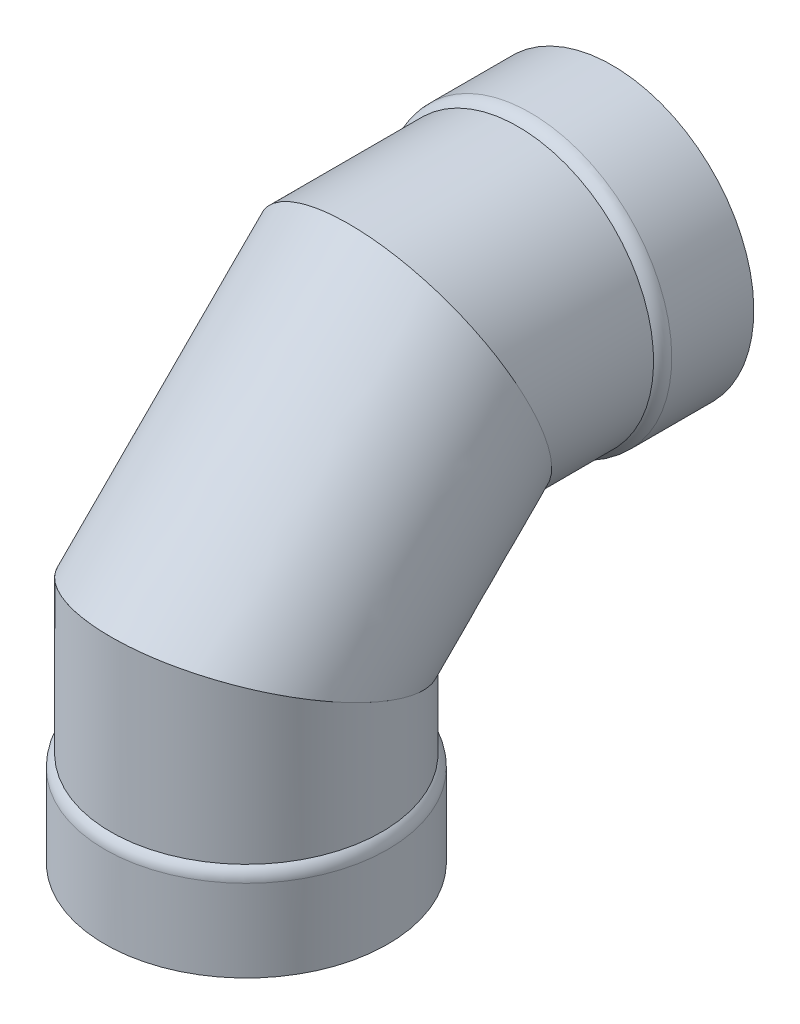
ISO-10303-21;
HEADER;
FILE_DESCRIPTION(('STEP AP214'),'2;1');
FILE_NAME('part.step','',(''),(''),'','','');
FILE_SCHEMA(('AUTOMOTIVE_DESIGN { 1 0 10303 214 1 1 1 1 }'));
ENDSEC;
DATA;
#1=APPLICATION_CONTEXT('core data for automotive mechanical design processes');
#2=APPLICATION_PROTOCOL_DEFINITION('international standard','automotive_design',2000,#1);
#3=PRODUCT_CONTEXT('',#1,'mechanical');
#4=PRODUCT('Part','Part','',(#3));
#5=PRODUCT_RELATED_PRODUCT_CATEGORY('part','',(#4));
#6=PRODUCT_DEFINITION_FORMATION('','',#4);
#7=PRODUCT_DEFINITION_CONTEXT('part definition',#1,'design');
#8=PRODUCT_DEFINITION('design','',#6,#7);
#9=PRODUCT_DEFINITION_SHAPE('','',#8);
#10=(LENGTH_UNIT() NAMED_UNIT(*) SI_UNIT(.MILLI.,.METRE.));
#11=(NAMED_UNIT(*) PLANE_ANGLE_UNIT() SI_UNIT($,.RADIAN.));
#12=(NAMED_UNIT(*) SI_UNIT($,.STERADIAN.) SOLID_ANGLE_UNIT());
#13=UNCERTAINTY_MEASURE_WITH_UNIT(LENGTH_MEASURE(1.E-05),#10,'distance_accuracy_value','');
#14=(GEOMETRIC_REPRESENTATION_CONTEXT(3) GLOBAL_UNCERTAINTY_ASSIGNED_CONTEXT((#13)) GLOBAL_UNIT_ASSIGNED_CONTEXT((#10,
#11,#12)) REPRESENTATION_CONTEXT('',''));
#15=CARTESIAN_POINT('',(0.,0.,0.));
#16=DIRECTION('',(0.,0.,1.));
#17=DIRECTION('',(1.,0.,0.));
#18=AXIS2_PLACEMENT_3D('',#15,#16,#17);
#19=CARTESIAN_POINT('',(0.,295.759197113444,-128.277947113444));
#20=DIRECTION('',(0.,-0.381760154419797,0.924261426490024));
#21=DIRECTION('',(0.,-0.924261426490024,-0.381760154419797));
#22=AXIS2_PLACEMENT_3D('',#19,#20,#21);
#23=PLANE('',#22);
#24=CARTESIAN_POINT('',(0.,295.759197113444,-128.277947113444));
#25=DIRECTION('',(0.,-0.381760154419797,0.924261426490024));
#26=DIRECTION('',(0.,-0.924261426490024,-0.381760154419797));
#27=AXIS2_PLACEMENT_3D('',#24,#25,#26);
#28=ELLIPSE('',#27,113.360784078043,104.775);
#29=CARTESIAN_POINT('',(0.,190.984197113444,-171.554577548227));
#30=VERTEX_POINT('',#29);
#31=EDGE_CURVE('E105',#30,#30,#28,.T.);
#32=ORIENTED_EDGE('',*,*,#31,.T.);
#33=EDGE_LOOP('',(#32));
#34=FACE_BOUND('',#33,.T.);
#35=CARTESIAN_POINT('',(0.,295.759197113444,-128.277947113444));
#36=DIRECTION('',(0.,-0.381760154419797,0.924261426490024));
#37=DIRECTION('',(0.,-0.924261426490024,-0.381760154419797));
#38=AXIS2_PLACEMENT_3D('',#35,#36,#37);
#39=ELLIPSE('',#38,118.513546990682,109.5375);
#40=CARTESIAN_POINT('',(0.,186.221697113444,-173.521697113444));
#41=VERTEX_POINT('',#40);
#42=EDGE_CURVE('E14',#41,#41,#39,.T.);
#43=ORIENTED_EDGE('',*,*,#42,.F.);
#44=EDGE_LOOP('',(#43));
#45=FACE_BOUND('',#44,.T.);
#46=ADVANCED_FACE('F88',(#34,#45),#23,.F.);
#47=CARTESIAN_POINT('',(0.,167.48125,0.));
#48=DIRECTION('',(0.,0.924261426490025,-0.381760154419793));
#49=DIRECTION('',(0.,0.381760154419793,0.924261426490025));
#50=AXIS2_PLACEMENT_3D('',#47,#48,#49);
#51=PLANE('',#50);
#52=CARTESIAN_POINT('',(0.,167.48125,0.));
#53=DIRECTION('',(0.,0.924261426490025,-0.381760154419793));
#54=DIRECTION('',(0.,-0.381760154419793,-0.924261426490025));
#55=AXIS2_PLACEMENT_3D('',#52,#53,#54);
#56=ELLIPSE('',#55,113.360784078043,104.775);
#57=CARTESIAN_POINT('',(0.,124.204619565217,-104.775));
#58=VERTEX_POINT('',#57);
#59=EDGE_CURVE('E119',#58,#58,#56,.T.);
#60=ORIENTED_EDGE('',*,*,#59,.T.);
#61=EDGE_LOOP('',(#60));
#62=FACE_BOUND('',#61,.T.);
#63=CARTESIAN_POINT('',(0.,167.48125,0.));
#64=DIRECTION('',(0.,0.924261426490025,-0.381760154419793));
#65=DIRECTION('',(0.,-0.381760154419793,-0.924261426490025));
#66=AXIS2_PLACEMENT_3D('',#63,#64,#65);
#67=ELLIPSE('',#66,118.513546990682,109.5375);
#68=CARTESIAN_POINT('',(0.,122.2375,-109.5375));
#69=VERTEX_POINT('',#68);
#70=EDGE_CURVE('E97',#69,#69,#67,.T.);
#71=ORIENTED_EDGE('',*,*,#70,.F.);
#72=EDGE_LOOP('',(#71));
#73=FACE_BOUND('',#72,.T.);
#74=ADVANCED_FACE('F127',(#62,#73),#51,.F.);
#75=CARTESIAN_POINT('',(0.0137264705965548,212.724999644761,109.537499139948));
#76=CARTESIAN_POINT('',(0.0441151894151282,405.296688229956,-83.0342007827096));
#77=CARTESIAN_POINT('',(219.088724750492,212.713660386442,109.510046198754));
#78=CARTESIAN_POINT('',(219.11909742244,405.208457851126,-83.07064376527));
#79=CARTESIAN_POINT('',(219.061271809299,122.22616109692,-109.564952081141));
#80=CARTESIAN_POINT('',(219.03086704361,186.133475618101,-173.558136426738));
#81=CARTESIAN_POINT('',(-0.0137264705966168,122.237500355239,-109.537499139948));
#82=CARTESIAN_POINT('',(-0.0441151894151416,186.221705996932,-173.521693444177));
#83=CARTESIAN_POINT('',(-219.088724750492,122.248839613558,-109.510046198754));
#84=CARTESIAN_POINT('',(-219.11909742244,186.309936375762,-173.485250461617));
#85=CARTESIAN_POINT('',(-219.061271809298,212.73633890308,109.564952081141));
#86=CARTESIAN_POINT('',(-219.03086704361,405.384918608787,-82.9977578001493));
#87=CARTESIAN_POINT('',(0.0137264705965548,212.724999644761,109.537499139948));
#88=CARTESIAN_POINT('',(0.0441151894151282,405.296688229956,-83.0342007827096));
#89=(BOUNDED_SURFACE() B_SPLINE_SURFACE(3,1,((#75,#76),(#77,#78),(#79,#80),(#81,#82),(#83,#84),
(#85,#86),(#87,#88)),.UNSPECIFIED.,.T.,.F.,.F.) B_SPLINE_SURFACE_WITH_KNOTS((4,3,4),(2,2),(0.,
0.5,1.),(0.,1.),.UNSPECIFIED.) GEOMETRIC_REPRESENTATION_ITEM() RATIONAL_B_SPLINE_SURFACE(((1.,
1.),(0.333333333333333,0.333333333333333),(0.333333333333333,0.333333333333333),(1.,1.),
(0.333333333333333,0.333333333333333),(0.333333333333333,0.333333333333333),(1.,1.))) REPRESENTATION_ITEM('') SURFACE());
#90=ORIENTED_EDGE('',*,*,#70,.T.);
#91=EDGE_LOOP('',(#90));
#92=FACE_BOUND('',#91,.T.);
#93=ORIENTED_EDGE('',*,*,#42,.T.);
#94=EDGE_LOOP('',(#93));
#95=FACE_BOUND('',#94,.T.);
#96=ADVANCED_FACE('F147',(#92,#95),#89,.T.);
#97=CARTESIAN_POINT('',(0.,124.204619565217,-104.775));
#98=CARTESIAN_POINT('',(0.,190.984197113444,-171.554577548227));
#99=CARTESIAN_POINT('',(-209.55,124.204619565217,-104.775));
#100=CARTESIAN_POINT('',(-209.55,190.984197113444,-171.554577548227));
#101=CARTESIAN_POINT('',(-209.55,210.757880434783,104.775));
#102=CARTESIAN_POINT('',(-209.55,400.534197113444,-85.0013166786605));
#103=CARTESIAN_POINT('',(0.,210.757880434783,104.775));
#104=CARTESIAN_POINT('',(0.,400.534197113444,-85.0013166786605));
#105=CARTESIAN_POINT('',(209.55,210.757880434783,104.775));
#106=CARTESIAN_POINT('',(209.55,400.534197113444,-85.0013166786605));
#107=CARTESIAN_POINT('',(209.55,124.204619565217,-104.775));
#108=CARTESIAN_POINT('',(209.55,190.984197113444,-171.554577548227));
#109=CARTESIAN_POINT('',(0.,124.204619565217,-104.775));
#110=CARTESIAN_POINT('',(0.,190.984197113444,-171.554577548227));
#111=(BOUNDED_SURFACE() B_SPLINE_SURFACE(3,1,((#97,#98),(#99,#100),(#101,#102),(#103,#104),
(#105,#106),(#107,#108),(#109,#110)),.UNSPECIFIED.,.T.,.F.,.F.) B_SPLINE_SURFACE_WITH_KNOTS((4,
3,4),(2,2),(0.,0.5,1.),(0.,1.),
.UNSPECIFIED.) GEOMETRIC_REPRESENTATION_ITEM() RATIONAL_B_SPLINE_SURFACE(((1.,1.),
(0.333333333333333,0.333333333333333),(0.333333333333333,0.333333333333333),(1.,1.),
(0.333333333333333,0.333333333333333),(0.333333333333333,0.333333333333333),(1.,1.))) REPRESENTATION_ITEM('') SURFACE());
#112=ORIENTED_EDGE('',*,*,#59,.F.);
#113=EDGE_LOOP('',(#112));
#114=FACE_BOUND('',#113,.T.);
#115=ORIENTED_EDGE('',*,*,#31,.F.);
#116=EDGE_LOOP('',(#115));
#117=FACE_BOUND('',#116,.T.);
#118=ADVANCED_FACE('F148',(#114,#117),#111,.F.);
#119=CLOSED_SHELL('',(#46,#74,#96,#118));
#120=MANIFOLD_SOLID_BREP('B2',#119);
#121=CARTESIAN_POINT('',(0.,295.759197113445,-347.872990216892));
#122=DIRECTION('',(0.,0.,-1.));
#123=DIRECTION('',(0.,-1.,0.));
#124=AXIS2_PLACEMENT_3D('',#121,#122,#123);
#125=CYLINDRICAL_SURFACE('',#124,109.5375);
#126=CARTESIAN_POINT('',(0.,295.759197113444,-219.559197113443));
#127=DIRECTION('',(0.,0.,1.));
#128=DIRECTION('',(0.,-1.,0.));
#129=AXIS2_PLACEMENT_3D('',#126,#127,#128);
#130=CIRCLE('',#129,109.5375);
#131=CARTESIAN_POINT('',(0.,186.221697113444,-219.559197113444));
#132=VERTEX_POINT('',#131);
#133=EDGE_CURVE('E297',#132,#132,#130,.T.);
#134=ORIENTED_EDGE('',*,*,#133,.T.);
#135=EDGE_LOOP('',(#134));
#136=FACE_BOUND('',#135,.T.);
#137=CARTESIAN_POINT('',(0.,295.759197113444,-128.277947113443));
#138=DIRECTION('',(0.,-0.381760154419797,0.924261426490024));
#139=DIRECTION('',(0.,-0.924261426490024,-0.381760154419796));
#140=AXIS2_PLACEMENT_3D('',#137,#138,#139);
#141=ELLIPSE('',#140,118.513546990682,109.5375);
#142=CARTESIAN_POINT('',(0.,186.221697113444,-173.521697113444));
#143=VERTEX_POINT('',#142);
#144=EDGE_CURVE('E309',#143,#143,#141,.T.);
#145=ORIENTED_EDGE('',*,*,#144,.F.);
#146=EDGE_LOOP('',(#145));
#147=FACE_BOUND('',#146,.T.);
#148=ADVANCED_FACE('F283',(#136,#147),#125,.T.);
#149=CARTESIAN_POINT('',(0.,295.759197113445,-347.872990216892));
#150=DIRECTION('',(0.,0.,-1.));
#151=DIRECTION('',(0.,-1.,0.));
#152=AXIS2_PLACEMENT_3D('',#149,#150,#151);
#153=CYLINDRICAL_SURFACE('',#152,114.3);
#154=CARTESIAN_POINT('',(0.,295.759197113444,-229.473131435901));
#155=DIRECTION('',(0.,0.,1.));
#156=DIRECTION('',(0.,-1.,0.));
#157=AXIS2_PLACEMENT_3D('',#154,#155,#156);
#158=CIRCLE('',#157,114.3);
#159=CARTESIAN_POINT('',(0.,181.459197113444,-229.473131435901));
#160=VERTEX_POINT('',#159);
#161=EDGE_CURVE('E291',#160,#160,#158,.F.);
#162=ORIENTED_EDGE('',*,*,#161,.T.);
#163=EDGE_LOOP('',(#162));
#164=FACE_BOUND('',#163,.T.);
#165=CARTESIAN_POINT('',(0.,295.759197113445,-295.759197113443));
#166=DIRECTION('',(0.,0.,1.));
#167=DIRECTION('',(0.,-1.,0.));
#168=AXIS2_PLACEMENT_3D('',#165,#166,#167);
#169=CIRCLE('',#168,114.3);
#170=CARTESIAN_POINT('',(0.,181.459197113445,-295.759197113444));
#171=VERTEX_POINT('',#170);
#172=EDGE_CURVE('E303',#171,#171,#169,.T.);
#173=ORIENTED_EDGE('',*,*,#172,.T.);
#174=EDGE_LOOP('',(#173));
#175=FACE_BOUND('',#174,.T.);
#176=ADVANCED_FACE('F330',(#164,#175),#153,.T.);
#177=CARTESIAN_POINT('',(0.,410.059197113445,-295.759197113443));
#178=DIRECTION('',(0.,0.,1.));
#179=DIRECTION('',(0.,1.,0.));
#180=AXIS2_PLACEMENT_3D('',#177,#178,#179);
#181=PLANE('',#180);
#182=CARTESIAN_POINT('',(0.,295.759197113445,-295.759197113443));
#183=DIRECTION('',(0.,0.,1.));
#184=DIRECTION('',(0.,-1.,0.));
#185=AXIS2_PLACEMENT_3D('',#182,#183,#184);
#186=CIRCLE('',#185,109.5375);
#187=CARTESIAN_POINT('',(0.,186.221697113445,-295.759197113444));
#188=VERTEX_POINT('',#187);
#189=EDGE_CURVE('E314',#188,#188,#186,.T.);
#190=ORIENTED_EDGE('',*,*,#189,.T.);
#191=EDGE_LOOP('',(#190));
#192=FACE_BOUND('',#191,.T.);
#193=ORIENTED_EDGE('',*,*,#172,.F.);
#194=EDGE_LOOP('',(#193));
#195=FACE_BOUND('',#194,.T.);
#196=ADVANCED_FACE('F336',(#192,#195),#181,.F.);
#197=CARTESIAN_POINT('',(0.,295.759197113445,-347.872990216892));
#198=DIRECTION('',(0.,0.,-1.));
#199=DIRECTION('',(0.,-1.,0.));
#200=AXIS2_PLACEMENT_3D('',#197,#198,#199);
#201=CYLINDRICAL_SURFACE('',#200,109.5375);
#202=CARTESIAN_POINT('',(0.,295.759197113444,-234.235631435901));
#203=DIRECTION('',(0.,0.,1.));
#204=DIRECTION('',(0.,-1.,0.));
#205=AXIS2_PLACEMENT_3D('',#202,#203,#204);
#206=CIRCLE('',#205,109.5375);
#207=CARTESIAN_POINT('',(0.,186.221697113444,-234.235631435901));
#208=VERTEX_POINT('',#207);
#209=EDGE_CURVE('E87',#208,#208,#206,.T.);
#210=ORIENTED_EDGE('',*,*,#209,.T.);
#211=EDGE_LOOP('',(#210));
#212=FACE_BOUND('',#211,.T.);
#213=ORIENTED_EDGE('',*,*,#189,.F.);
#214=EDGE_LOOP('',(#213));
#215=FACE_BOUND('',#214,.T.);
#216=ADVANCED_FACE('F355',(#212,#215),#201,.F.);
#217=CARTESIAN_POINT('',(0.,295.759197113445,-347.872990216892));
#218=DIRECTION('',(0.,0.,-1.));
#219=DIRECTION('',(0.,-1.,0.));
#220=AXIS2_PLACEMENT_3D('',#217,#218,#219);
#221=CYLINDRICAL_SURFACE('',#220,104.775);
#222=CARTESIAN_POINT('',(0.,295.759197113444,-128.277947113443));
#223=DIRECTION('',(0.,-0.381760154419797,0.924261426490024));
#224=DIRECTION('',(0.,-0.924261426490024,-0.381760154419796));
#225=AXIS2_PLACEMENT_3D('',#222,#223,#224);
#226=ELLIPSE('',#225,113.360784078043,104.775);
#227=CARTESIAN_POINT('',(0.,190.984197113444,-171.554577548226));
#228=VERTEX_POINT('',#227);
#229=EDGE_CURVE('E306',#228,#228,#226,.F.);
#230=ORIENTED_EDGE('',*,*,#229,.F.);
#231=EDGE_LOOP('',(#230));
#232=FACE_BOUND('',#231,.T.);
#233=CARTESIAN_POINT('',(0.,295.759197113444,-224.321697113443));
#234=DIRECTION('',(0.,0.,1.));
#235=DIRECTION('',(0.,-1.,0.));
#236=AXIS2_PLACEMENT_3D('',#233,#234,#235);
#237=CIRCLE('',#236,104.775);
#238=CARTESIAN_POINT('',(0.,190.984197113444,-224.321697113444));
#239=VERTEX_POINT('',#238);
#240=EDGE_CURVE('E318',#239,#239,#237,.T.);
#241=ORIENTED_EDGE('',*,*,#240,.F.);
#242=EDGE_LOOP('',(#241));
#243=FACE_BOUND('',#242,.T.);
#244=ADVANCED_FACE('F347',(#232,#243),#221,.F.);
#245=CARTESIAN_POINT('',(-114.3,405.296697113444,-83.0341971134431));
#246=DIRECTION('',(0.,0.381760154419797,-0.924261426490024));
#247=DIRECTION('',(0.,-0.924261426490024,-0.381760154419796));
#248=AXIS2_PLACEMENT_3D('',#245,#246,#247);
#249=PLANE('',#248);
#250=ORIENTED_EDGE('',*,*,#229,.T.);
#251=EDGE_LOOP('',(#250));
#252=FACE_BOUND('',#251,.T.);
#253=ORIENTED_EDGE('',*,*,#144,.T.);
#254=EDGE_LOOP('',(#253));
#255=FACE_BOUND('',#254,.T.);
#256=ADVANCED_FACE('F327',(#252,#255),#249,.F.);
#257=CARTESIAN_POINT('',(0.,295.759197113444,-229.473131435901));
#258=DIRECTION('',(0.,0.,1.));
#259=DIRECTION('',(0.,-1.,0.));
#260=AXIS2_PLACEMENT_3D('',#257,#258,#259);
#261=TOROIDAL_SURFACE('',#260,101.6,12.7);
#262=ORIENTED_EDGE('',*,*,#161,.F.);
#263=EDGE_LOOP('',(#262));
#264=FACE_BOUND('',#263,.T.);
#265=ORIENTED_EDGE('',*,*,#133,.F.);
#266=EDGE_LOOP('',(#265));
#267=FACE_BOUND('',#266,.T.);
#268=ADVANCED_FACE('F339',(#264,#267),#261,.T.);
#269=CARTESIAN_POINT('',(0.,295.759197113444,-234.235631435901));
#270=DIRECTION('',(0.,0.,1.));
#271=DIRECTION('',(0.,-1.,0.));
#272=AXIS2_PLACEMENT_3D('',#269,#270,#271);
#273=TOROIDAL_SURFACE('',#272,96.8375,12.7);
#274=ORIENTED_EDGE('',*,*,#240,.T.);
#275=EDGE_LOOP('',(#274));
#276=FACE_BOUND('',#275,.T.);
#277=ORIENTED_EDGE('',*,*,#209,.F.);
#278=EDGE_LOOP('',(#277));
#279=FACE_BOUND('',#278,.T.);
#280=ADVANCED_FACE('F285',(#276,#279),#273,.F.);
#281=CLOSED_SHELL('',(#148,#176,#196,#216,#244,#256,#268,#280));
#282=MANIFOLD_SOLID_BREP('B9',#281);
#283=CARTESIAN_POINT('',(0.,-52.1137931034483,0.));
#284=DIRECTION('',(0.,-1.,0.));
#285=DIRECTION('',(0.,0.,-1.));
#286=AXIS2_PLACEMENT_3D('',#283,#284,#285);
#287=CYLINDRICAL_SURFACE('',#286,109.5375);
#288=CARTESIAN_POINT('',(0.,76.2,0.));
#289=DIRECTION('',(0.,-1.,0.));
#290=DIRECTION('',(0.,0.,-1.));
#291=AXIS2_PLACEMENT_3D('',#288,#289,#290);
#292=CIRCLE('',#291,109.5375);
#293=CARTESIAN_POINT('',(0.,76.2,-109.5375));
#294=VERTEX_POINT('',#293);
#295=EDGE_CURVE('E457',#294,#294,#292,.T.);
#296=ORIENTED_EDGE('',*,*,#295,.F.);
#297=EDGE_LOOP('',(#296));
#298=FACE_BOUND('',#297,.T.);
#299=CARTESIAN_POINT('',(0.,167.48125,0.));
#300=DIRECTION('',(0.,-0.924261426490025,0.381760154419793));
#301=DIRECTION('',(0.,-0.381760154419793,-0.924261426490025));
#302=AXIS2_PLACEMENT_3D('',#299,#300,#301);
#303=ELLIPSE('',#302,118.513546990682,109.5375);
#304=CARTESIAN_POINT('',(0.,122.2375,-109.5375));
#305=VERTEX_POINT('',#304);
#306=EDGE_CURVE('E469',#305,#305,#303,.T.);
#307=ORIENTED_EDGE('',*,*,#306,.T.);
#308=EDGE_LOOP('',(#307));
#309=FACE_BOUND('',#308,.T.);
#310=ADVANCED_FACE('F443',(#298,#309),#287,.T.);
#311=CARTESIAN_POINT('',(0.,-52.1137931034483,0.));
#312=DIRECTION('',(0.,-1.,0.));
#313=DIRECTION('',(0.,0.,-1.));
#314=AXIS2_PLACEMENT_3D('',#311,#312,#313);
#315=CYLINDRICAL_SURFACE('',#314,114.3);
#316=CARTESIAN_POINT('',(0.,66.2860656775425,0.));
#317=DIRECTION('',(0.,1.,0.));
#318=DIRECTION('',(0.,0.,1.));
#319=AXIS2_PLACEMENT_3D('',#316,#317,#318);
#320=CIRCLE('',#319,114.3);
#321=CARTESIAN_POINT('',(0.,66.2860656775425,114.3));
#322=VERTEX_POINT('',#321);
#323=EDGE_CURVE('E282',#322,#322,#320,.F.);
#324=ORIENTED_EDGE('',*,*,#323,.T.);
#325=EDGE_LOOP('',(#324));
#326=FACE_BOUND('',#325,.T.);
#327=CARTESIAN_POINT('',(0.,0.,0.));
#328=DIRECTION('',(0.,-1.,0.));
#329=DIRECTION('',(0.,0.,-1.));
#330=AXIS2_PLACEMENT_3D('',#327,#328,#329);
#331=CIRCLE('',#330,114.3);
#332=CARTESIAN_POINT('',(0.,0.,-114.3));
#333=VERTEX_POINT('',#332);
#334=EDGE_CURVE('E463',#333,#333,#331,.T.);
#335=ORIENTED_EDGE('',*,*,#334,.F.);
#336=EDGE_LOOP('',(#335));
#337=FACE_BOUND('',#336,.T.);
#338=ADVANCED_FACE('F504',(#326,#337),#315,.T.);
#339=CARTESIAN_POINT('',(0.,0.,114.3));
#340=DIRECTION('',(0.,1.,0.));
#341=DIRECTION('',(0.,0.,1.));
#342=AXIS2_PLACEMENT_3D('',#339,#340,#341);
#343=PLANE('',#342);
#344=CARTESIAN_POINT('',(0.,0.,0.));
#345=DIRECTION('',(0.,-1.,0.));
#346=DIRECTION('',(0.,0.,-1.));
#347=AXIS2_PLACEMENT_3D('',#344,#345,#346);
#348=CIRCLE('',#347,109.5375);
#349=CARTESIAN_POINT('',(0.,0.,-109.5375));
#350=VERTEX_POINT('',#349);
#351=EDGE_CURVE('E474',#350,#350,#348,.T.);
#352=ORIENTED_EDGE('',*,*,#351,.F.);
#353=EDGE_LOOP('',(#352));
#354=FACE_BOUND('',#353,.T.);
#355=ORIENTED_EDGE('',*,*,#334,.T.);
#356=EDGE_LOOP('',(#355));
#357=FACE_BOUND('',#356,.T.);
#358=ADVANCED_FACE('F510',(#354,#357),#343,.F.);
#359=CARTESIAN_POINT('',(0.,-52.1137931034483,0.));
#360=DIRECTION('',(0.,-1.,0.));
#361=DIRECTION('',(0.,0.,-1.));
#362=AXIS2_PLACEMENT_3D('',#359,#360,#361);
#363=CYLINDRICAL_SURFACE('',#362,109.5375);
#364=CARTESIAN_POINT('',(0.,61.5235656775425,0.));
#365=DIRECTION('',(0.,1.,0.));
#366=DIRECTION('',(0.,0.,1.));
#367=AXIS2_PLACEMENT_3D('',#364,#365,#366);
#368=CIRCLE('',#367,109.5375);
#369=CARTESIAN_POINT('',(0.,61.5235656775425,109.5375));
#370=VERTEX_POINT('',#369);
#371=EDGE_CURVE('E451',#370,#370,#368,.T.);
#372=ORIENTED_EDGE('',*,*,#371,.T.);
#373=EDGE_LOOP('',(#372));
#374=FACE_BOUND('',#373,.T.);
#375=ORIENTED_EDGE('',*,*,#351,.T.);
#376=EDGE_LOOP('',(#375));
#377=FACE_BOUND('',#376,.T.);
#378=ADVANCED_FACE('F499',(#374,#377),#363,.F.);
#379=CARTESIAN_POINT('',(0.,-52.1137931034483,0.));
#380=DIRECTION('',(0.,-1.,0.));
#381=DIRECTION('',(0.,0.,-1.));
#382=AXIS2_PLACEMENT_3D('',#379,#380,#381);
#383=CYLINDRICAL_SURFACE('',#382,104.775);
#384=CARTESIAN_POINT('',(0.,167.48125,0.));
#385=DIRECTION('',(0.,-0.924261426490025,0.381760154419793));
#386=DIRECTION('',(0.,-0.381760154419793,-0.924261426490025));
#387=AXIS2_PLACEMENT_3D('',#384,#385,#386);
#388=ELLIPSE('',#387,113.360784078043,104.775);
#389=CARTESIAN_POINT('',(0.,124.204619565217,-104.775));
#390=VERTEX_POINT('',#389);
#391=EDGE_CURVE('E466',#390,#390,#388,.F.);
#392=ORIENTED_EDGE('',*,*,#391,.T.);
#393=EDGE_LOOP('',(#392));
#394=FACE_BOUND('',#393,.T.);
#395=CARTESIAN_POINT('',(0.,71.4375,0.));
#396=DIRECTION('',(0.,-1.,0.));
#397=DIRECTION('',(0.,0.,-1.));
#398=AXIS2_PLACEMENT_3D('',#395,#396,#397);
#399=CIRCLE('',#398,104.775);
#400=CARTESIAN_POINT('',(0.,71.4375,-104.775));
#401=VERTEX_POINT('',#400);
#402=EDGE_CURVE('E478',#401,#401,#399,.T.);
#403=ORIENTED_EDGE('',*,*,#402,.T.);
#404=EDGE_LOOP('',(#403));
#405=FACE_BOUND('',#404,.T.);
#406=ADVANCED_FACE('F491',(#394,#405),#383,.F.);
#407=CARTESIAN_POINT('',(-114.3,212.725,109.5375));
#408=DIRECTION('',(0.,-0.924261426490025,0.381760154419793));
#409=DIRECTION('',(0.,-0.381760154419793,-0.924261426490025));
#410=AXIS2_PLACEMENT_3D('',#407,#408,#409);
#411=PLANE('',#410);
#412=ORIENTED_EDGE('',*,*,#391,.F.);
#413=EDGE_LOOP('',(#412));
#414=FACE_BOUND('',#413,.T.);
#415=ORIENTED_EDGE('',*,*,#306,.F.);
#416=EDGE_LOOP('',(#415));
#417=FACE_BOUND('',#416,.T.);
#418=ADVANCED_FACE('F488',(#414,#417),#411,.F.);
#419=CARTESIAN_POINT('',(0.,61.5235656775425,0.));
#420=DIRECTION('',(0.,1.,0.));
#421=DIRECTION('',(0.,0.,1.));
#422=AXIS2_PLACEMENT_3D('',#419,#420,#421);
#423=TOROIDAL_SURFACE('',#422,96.8375,12.7);
#424=ORIENTED_EDGE('',*,*,#371,.F.);
#425=EDGE_LOOP('',(#424));
#426=FACE_BOUND('',#425,.T.);
#427=ORIENTED_EDGE('',*,*,#402,.F.);
#428=EDGE_LOOP('',(#427));
#429=FACE_BOUND('',#428,.T.);
#430=ADVANCED_FACE('F490',(#426,#429),#423,.F.);
#431=CARTESIAN_POINT('',(0.,66.2860656775425,0.));
#432=DIRECTION('',(0.,1.,0.));
#433=DIRECTION('',(0.,0.,1.));
#434=AXIS2_PLACEMENT_3D('',#431,#432,#433);
#435=TOROIDAL_SURFACE('',#434,101.6,12.7);
#436=ORIENTED_EDGE('',*,*,#295,.T.);
#437=EDGE_LOOP('',(#436));
#438=FACE_BOUND('',#437,.T.);
#439=ORIENTED_EDGE('',*,*,#323,.F.);
#440=EDGE_LOOP('',(#439));
#441=FACE_BOUND('',#440,.T.);
#442=ADVANCED_FACE('F445',(#438,#441),#435,.T.);
#443=CLOSED_SHELL('',(#310,#338,#358,#378,#406,#418,#430,#442));
#444=MANIFOLD_SOLID_BREP('B82',#443);
#445=ADVANCED_BREP_SHAPE_REPRESENTATION('',(#18,#120,#282,#444),#14);
#446=SHAPE_DEFINITION_REPRESENTATION(#9,#445);
ENDSEC;
END-ISO-10303-21;
